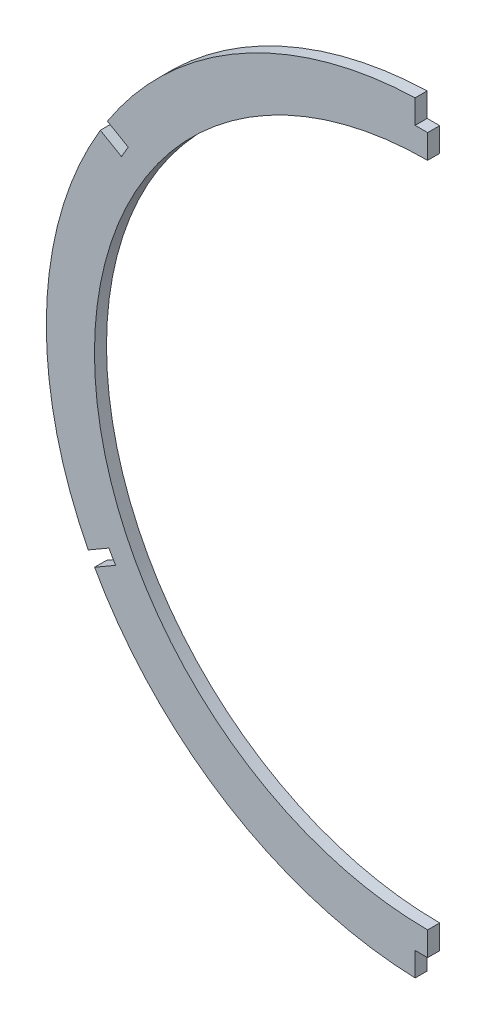
ISO-10303-21;
HEADER;
FILE_DESCRIPTION(('STEP AP214'),'2;1');
FILE_NAME('part.step','',(''),(''),'','','');
FILE_SCHEMA(('AUTOMOTIVE_DESIGN { 1 0 10303 214 1 1 1 1 }'));
ENDSEC;
DATA;
#1=APPLICATION_CONTEXT('core data for automotive mechanical design processes');
#2=APPLICATION_PROTOCOL_DEFINITION('international standard','automotive_design',2000,#1);
#3=PRODUCT_CONTEXT('',#1,'mechanical');
#4=PRODUCT('Part','Part','',(#3));
#5=PRODUCT_RELATED_PRODUCT_CATEGORY('part','',(#4));
#6=PRODUCT_DEFINITION_FORMATION('','',#4);
#7=PRODUCT_DEFINITION_CONTEXT('part definition',#1,'design');
#8=PRODUCT_DEFINITION('design','',#6,#7);
#9=PRODUCT_DEFINITION_SHAPE('','',#8);
#10=(LENGTH_UNIT() NAMED_UNIT(*) SI_UNIT(.MILLI.,.METRE.));
#11=(NAMED_UNIT(*) PLANE_ANGLE_UNIT() SI_UNIT($,.RADIAN.));
#12=(NAMED_UNIT(*) SI_UNIT($,.STERADIAN.) SOLID_ANGLE_UNIT());
#13=UNCERTAINTY_MEASURE_WITH_UNIT(LENGTH_MEASURE(1.E-05),#10,'distance_accuracy_value','');
#14=(GEOMETRIC_REPRESENTATION_CONTEXT(3) GLOBAL_UNCERTAINTY_ASSIGNED_CONTEXT((#13)) GLOBAL_UNIT_ASSIGNED_CONTEXT((#10,
#11,#12)) REPRESENTATION_CONTEXT('',''));
#15=CARTESIAN_POINT('',(0.,0.,0.));
#16=DIRECTION('',(0.,0.,1.));
#17=DIRECTION('',(1.,0.,0.));
#18=AXIS2_PLACEMENT_3D('',#15,#16,#17);
#19=CARTESIAN_POINT('',(0.,6.07817424837746,-3.175));
#20=DIRECTION('',(0.,0.,1.));
#21=DIRECTION('',(1.,0.,0.));
#22=AXIS2_PLACEMENT_3D('',#19,#20,#21);
#23=CYLINDRICAL_SURFACE('',#22,100.601825751622);
#24=DIRECTION('',(0.,0.,1.));
#25=VECTOR('',#24,1.);
#26=CARTESIAN_POINT('',(-89.5376660151082,-39.7883027160326,-3.175));
#27=LINE('',#26,#25);
#28=CARTESIAN_POINT('',(-89.5376660151082,-39.7883027160326,0.));
#29=VERTEX_POINT('',#28);
#30=CARTESIAN_POINT('',(-89.5376660151081,-39.7883027160326,-3.175));
#31=VERTEX_POINT('',#30);
#32=EDGE_CURVE('E233',#29,#31,#27,.F.);
#33=ORIENTED_EDGE('',*,*,#32,.F.);
#34=CARTESIAN_POINT('',(0.,6.07817424837746,0.));
#35=DIRECTION('',(0.,0.,1.));
#36=DIRECTION('',(1.,0.,0.));
#37=AXIS2_PLACEMENT_3D('',#34,#35,#36);
#38=CIRCLE('',#37,100.601825751622);
#39=CARTESIAN_POINT('',(-86.3554854902251,57.6868699333813,0.));
#40=VERTEX_POINT('',#39);
#41=EDGE_CURVE('E171',#40,#29,#38,.T.);
#42=ORIENTED_EDGE('',*,*,#41,.F.);
#43=DIRECTION('',(0.,0.,1.));
#44=VECTOR('',#43,1.);
#45=CARTESIAN_POINT('',(-86.3554854902251,57.6868699333813,-3.175));
#46=LINE('',#45,#44);
#47=CARTESIAN_POINT('',(-86.355485490225,57.6868699333813,-3.175));
#48=VERTEX_POINT('',#47);
#49=EDGE_CURVE('E58',#48,#40,#46,.T.);
#50=ORIENTED_EDGE('',*,*,#49,.F.);
#51=CARTESIAN_POINT('',(0.,6.07817424837746,-3.175));
#52=DIRECTION('',(0.,0.,1.));
#53=DIRECTION('',(1.,0.,0.));
#54=AXIS2_PLACEMENT_3D('',#51,#52,#53);
#55=CIRCLE('',#54,100.601825751622);
#56=EDGE_CURVE('E255',#48,#31,#55,.T.);
#57=ORIENTED_EDGE('',*,*,#56,.T.);
#58=EDGE_LOOP('',(#33,#42,#50,#57));
#59=FACE_BOUND('',#58,.T.);
#60=ADVANCED_FACE('F36',(#59),#23,.T.);
#61=DIRECTION('',(0.,0.,1.));
#62=VECTOR('',#61,1.);
#63=CARTESIAN_POINT('',(-3.302,106.625795505968,-3.175));
#64=LINE('',#63,#62);
#65=CARTESIAN_POINT('',(-3.302,106.625795505968,-3.175));
#66=VERTEX_POINT('',#65);
#67=CARTESIAN_POINT('',(-3.302,106.625795505968,0.));
#68=VERTEX_POINT('',#67);
#69=EDGE_CURVE('E237',#66,#68,#64,.T.);
#70=ORIENTED_EDGE('',*,*,#69,.F.);
#71=CARTESIAN_POINT('',(-84.490367240827,60.6868291308226,-3.175));
#72=VERTEX_POINT('',#71);
#73=EDGE_CURVE('E257',#66,#72,#55,.T.);
#74=ORIENTED_EDGE('',*,*,#73,.T.);
#75=DIRECTION('',(0.,0.,1.));
#76=VECTOR('',#75,1.);
#77=CARTESIAN_POINT('',(-84.490367240827,60.6868291308226,-3.175));
#78=LINE('',#77,#76);
#79=CARTESIAN_POINT('',(-84.490367240827,60.6868291308226,0.));
#80=VERTEX_POINT('',#79);
#81=EDGE_CURVE('E230',#80,#72,#78,.F.);
#82=ORIENTED_EDGE('',*,*,#81,.F.);
#83=EDGE_CURVE('E256',#68,#80,#38,.T.);
#84=ORIENTED_EDGE('',*,*,#83,.F.);
#85=EDGE_LOOP('',(#70,#74,#82,#84));
#86=FACE_BOUND('',#85,.T.);
#87=ADVANCED_FACE('F279',(#86),#23,.T.);
#88=DIRECTION('',(0.,0.,1.));
#89=VECTOR('',#88,1.);
#90=CARTESIAN_POINT('',(-3.30199999999999,-94.4694470092128,-3.175));
#91=LINE('',#90,#89);
#92=CARTESIAN_POINT('',(-3.30199999999999,-94.4694470092128,0.));
#93=VERTEX_POINT('',#92);
#94=CARTESIAN_POINT('',(-3.30199999999999,-94.4694470092127,-3.175));
#95=VERTEX_POINT('',#94);
#96=EDGE_CURVE('E235',#93,#95,#91,.F.);
#97=ORIENTED_EDGE('',*,*,#96,.F.);
#98=CARTESIAN_POINT('',(-87.8721842645062,-42.903522099794,0.));
#99=VERTEX_POINT('',#98);
#100=EDGE_CURVE('E248',#99,#93,#38,.T.);
#101=ORIENTED_EDGE('',*,*,#100,.F.);
#102=DIRECTION('',(0.,0.,1.));
#103=VECTOR('',#102,1.);
#104=CARTESIAN_POINT('',(-87.8721842645062,-42.903522099794,-3.175));
#105=LINE('',#104,#103);
#106=CARTESIAN_POINT('',(-87.8721842645062,-42.903522099794,-3.175));
#107=VERTEX_POINT('',#106);
#108=EDGE_CURVE('E50',#107,#99,#105,.T.);
#109=ORIENTED_EDGE('',*,*,#108,.F.);
#110=EDGE_CURVE('E252',#107,#95,#55,.T.);
#111=ORIENTED_EDGE('',*,*,#110,.T.);
#112=EDGE_LOOP('',(#97,#101,#109,#111));
#113=FACE_BOUND('',#112,.T.);
#114=ADVANCED_FACE('F38',(#113),#23,.T.);
#115=CARTESIAN_POINT('',(0.,6.07817424837746,-3.175));
#116=DIRECTION('',(0.,0.,1.));
#117=DIRECTION('',(1.,0.,0.));
#118=AXIS2_PLACEMENT_3D('',#115,#116,#117);
#119=PLANE('',#118);
#120=ORIENTED_EDGE('',*,*,#73,.F.);
#121=DIRECTION('',(0.,-1.,0.));
#122=VECTOR('',#121,1.);
#123=CARTESIAN_POINT('',(-3.302,110.295839278736,-3.175));
#124=LINE('',#123,#122);
#125=CARTESIAN_POINT('',(-3.302,100.33,-3.175));
#126=VERTEX_POINT('',#125);
#127=EDGE_CURVE('E208',#66,#126,#124,.T.);
#128=ORIENTED_EDGE('',*,*,#127,.T.);
#129=DIRECTION('',(1.,0.,0.));
#130=VECTOR('',#129,1.);
#131=CARTESIAN_POINT('',(-3.302,100.33,-3.175));
#132=LINE('',#131,#130);
#133=CARTESIAN_POINT('',(0.,100.33,-3.175));
#134=VERTEX_POINT('',#133);
#135=EDGE_CURVE('E202',#126,#134,#132,.T.);
#136=ORIENTED_EDGE('',*,*,#135,.T.);
#137=DIRECTION('',(0.,1.,0.));
#138=VECTOR('',#137,1.);
#139=CARTESIAN_POINT('',(0.,6.07817424837746,-3.175));
#140=LINE('',#139,#138);
#141=CARTESIAN_POINT('',(0.,93.98,-3.175));
#142=VERTEX_POINT('',#141);
#143=EDGE_CURVE('E244',#142,#134,#140,.T.);
#144=ORIENTED_EDGE('',*,*,#143,.F.);
#145=CARTESIAN_POINT('',(0.,6.07817424837746,-3.175));
#146=DIRECTION('',(0.,0.,1.));
#147=DIRECTION('',(1.,0.,0.));
#148=AXIS2_PLACEMENT_3D('',#145,#146,#147);
#149=CIRCLE('',#148,87.9018257516225);
#150=CARTESIAN_POINT('',(0.,-81.8236515032451,-3.175));
#151=VERTEX_POINT('',#150);
#152=EDGE_CURVE('E245',#142,#151,#149,.T.);
#153=ORIENTED_EDGE('',*,*,#152,.T.);
#154=CARTESIAN_POINT('',(0.,-88.1736515032451,-3.175));
#155=VERTEX_POINT('',#154);
#156=EDGE_CURVE('E241',#155,#151,#140,.T.);
#157=ORIENTED_EDGE('',*,*,#156,.F.);
#158=DIRECTION('',(-1.,0.,0.));
#159=VECTOR('',#158,1.);
#160=CARTESIAN_POINT('',(0.,-88.1736515032451,-3.175));
#161=LINE('',#160,#159);
#162=CARTESIAN_POINT('',(-3.30199999999999,-88.1736515032451,-3.175));
#163=VERTEX_POINT('',#162);
#164=EDGE_CURVE('E192',#155,#163,#161,.T.);
#165=ORIENTED_EDGE('',*,*,#164,.T.);
#166=DIRECTION('',(0.,-1.,0.));
#167=VECTOR('',#166,1.);
#168=CARTESIAN_POINT('',(-3.30199999999999,-88.1736515032451,-3.175));
#169=LINE('',#168,#167);
#170=EDGE_CURVE('E186',#163,#95,#169,.T.);
#171=ORIENTED_EDGE('',*,*,#170,.T.);
#172=ORIENTED_EDGE('',*,*,#110,.F.);
#173=DIRECTION('',(0.86602540378444,0.499999999999997,0.));
#174=VECTOR('',#173,1.);
#175=CARTESIAN_POINT('',(-90.4575356913942,-44.3961754420575,-3.175));
#176=LINE('',#175,#174);
#177=CARTESIAN_POINT('',(-82.3297448298109,-39.7035932002055,-3.175));
#178=VERTEX_POINT('',#177);
#179=EDGE_CURVE('E180',#107,#178,#176,.T.);
#180=ORIENTED_EDGE('',*,*,#179,.T.);
#181=DIRECTION('',(-0.5,0.866025403784439,0.));
#182=VECTOR('',#181,1.);
#183=CARTESIAN_POINT('',(-84.095044829811,-36.6460039096041,-3.175));
#184=LINE('',#183,#182);
#185=CARTESIAN_POINT('',(-84.095044829811,-36.6460039096041,-3.175));
#186=VERTEX_POINT('',#185);
#187=EDGE_CURVE('E178',#178,#186,#184,.T.);
#188=ORIENTED_EDGE('',*,*,#187,.T.);
#189=DIRECTION('',(-0.866025403784437,-0.500000000000003,0.));
#190=VECTOR('',#189,1.);
#191=CARTESIAN_POINT('',(-92.2228356913943,-41.3385861514562,-3.175));
#192=LINE('',#191,#190);
#193=EDGE_CURVE('E154',#186,#31,#192,.T.);
#194=ORIENTED_EDGE('',*,*,#193,.T.);
#195=ORIENTED_EDGE('',*,*,#56,.F.);
#196=DIRECTION('',(0.866025403784439,-0.499999999999999,0.));
#197=VECTOR('',#196,1.);
#198=CARTESIAN_POINT('',(-89.8744108222375,59.7185224210769,-3.175));
#199=LINE('',#198,#197);
#200=CARTESIAN_POINT('',(-80.7618623707427,54.4573901196029,-3.175));
#201=VERTEX_POINT('',#200);
#202=EDGE_CURVE('E214',#48,#201,#199,.T.);
#203=ORIENTED_EDGE('',*,*,#202,.T.);
#204=DIRECTION('',(0.500000000000001,0.866025403784438,0.));
#205=VECTOR('',#204,1.);
#206=CARTESIAN_POINT('',(-80.7618623707427,54.4573901196029,-3.175));
#207=LINE('',#206,#205);
#208=CARTESIAN_POINT('',(-78.9965623707427,57.5149794102042,-3.175));
#209=VERTEX_POINT('',#208);
#210=EDGE_CURVE('E217',#201,#209,#207,.T.);
#211=ORIENTED_EDGE('',*,*,#210,.T.);
#212=DIRECTION('',(-0.866025403784438,0.500000000000002,0.));
#213=VECTOR('',#212,1.);
#214=CARTESIAN_POINT('',(-88.1091108222374,62.7761117116782,-3.175));
#215=LINE('',#214,#213);
#216=EDGE_CURVE('E220',#209,#72,#215,.T.);
#217=ORIENTED_EDGE('',*,*,#216,.T.);
#218=EDGE_LOOP('',(#120,#128,#136,#144,#153,#157,#165,#171,#172,#180,#188,#194,#195,#203,#211,#217));
#219=FACE_BOUND('',#218,.T.);
#220=ADVANCED_FACE('F285',(#219),#119,.F.);
#221=CARTESIAN_POINT('',(0.,6.07817424837746,0.));
#222=DIRECTION('',(0.,0.,1.));
#223=DIRECTION('',(1.,0.,0.));
#224=AXIS2_PLACEMENT_3D('',#221,#222,#223);
#225=PLANE('',#224);
#226=DIRECTION('',(0.,-1.,0.));
#227=VECTOR('',#226,1.);
#228=CARTESIAN_POINT('',(-3.302,110.295839278736,0.));
#229=LINE('',#228,#227);
#230=CARTESIAN_POINT('',(-3.302,100.33,0.));
#231=VERTEX_POINT('',#230);
#232=EDGE_CURVE('E189',#68,#231,#229,.T.);
#233=ORIENTED_EDGE('',*,*,#232,.F.);
#234=ORIENTED_EDGE('',*,*,#83,.T.);
#235=DIRECTION('',(-0.866025403784438,0.500000000000002,0.));
#236=VECTOR('',#235,1.);
#237=CARTESIAN_POINT('',(-88.1091108222374,62.7761117116782,0.));
#238=LINE('',#237,#236);
#239=CARTESIAN_POINT('',(-78.9965623707427,57.5149794102042,0.));
#240=VERTEX_POINT('',#239);
#241=EDGE_CURVE('E175',#240,#80,#238,.T.);
#242=ORIENTED_EDGE('',*,*,#241,.F.);
#243=DIRECTION('',(0.500000000000001,0.866025403784438,0.));
#244=VECTOR('',#243,1.);
#245=CARTESIAN_POINT('',(-80.7618623707427,54.4573901196029,0.));
#246=LINE('',#245,#244);
#247=CARTESIAN_POINT('',(-80.7618623707427,54.4573901196029,0.));
#248=VERTEX_POINT('',#247);
#249=EDGE_CURVE('E172',#248,#240,#246,.T.);
#250=ORIENTED_EDGE('',*,*,#249,.F.);
#251=DIRECTION('',(0.866025403784439,-0.499999999999999,0.));
#252=VECTOR('',#251,1.);
#253=CARTESIAN_POINT('',(0.758349387140626,7.39167391679375,0.));
#254=LINE('',#253,#252);
#255=EDGE_CURVE('E44',#40,#248,#254,.T.);
#256=ORIENTED_EDGE('',*,*,#255,.F.);
#257=ORIENTED_EDGE('',*,*,#41,.T.);
#258=DIRECTION('',(-0.866025403784437,-0.500000000000003,0.));
#259=VECTOR('',#258,1.);
#260=CARTESIAN_POINT('',(-92.2228356913943,-41.3385861514562,0.));
#261=LINE('',#260,#259);
#262=CARTESIAN_POINT('',(-84.095044829811,-36.6460039096041,0.));
#263=VERTEX_POINT('',#262);
#264=EDGE_CURVE('E151',#263,#29,#261,.T.);
#265=ORIENTED_EDGE('',*,*,#264,.F.);
#266=DIRECTION('',(-0.5,0.866025403784439,0.));
#267=VECTOR('',#266,1.);
#268=CARTESIAN_POINT('',(-84.095044829811,-36.6460039096041,0.));
#269=LINE('',#268,#267);
#270=CARTESIAN_POINT('',(-82.3297448298109,-39.7035932002055,0.));
#271=VERTEX_POINT('',#270);
#272=EDGE_CURVE('E163',#271,#263,#269,.T.);
#273=ORIENTED_EDGE('',*,*,#272,.F.);
#274=DIRECTION('',(0.86602540378444,0.499999999999997,0.));
#275=VECTOR('',#274,1.);
#276=CARTESIAN_POINT('',(-0.758349387140411,7.39167391679339,0.));
#277=LINE('',#276,#275);
#278=EDGE_CURVE('E11',#99,#271,#277,.T.);
#279=ORIENTED_EDGE('',*,*,#278,.F.);
#280=ORIENTED_EDGE('',*,*,#100,.T.);
#281=DIRECTION('',(0.,-1.,0.));
#282=VECTOR('',#281,1.);
#283=CARTESIAN_POINT('',(-3.30199999999999,-88.1736515032451,0.));
#284=LINE('',#283,#282);
#285=CARTESIAN_POINT('',(-3.30199999999999,-88.1736515032451,0.));
#286=VERTEX_POINT('',#285);
#287=EDGE_CURVE('E190',#286,#93,#284,.T.);
#288=ORIENTED_EDGE('',*,*,#287,.F.);
#289=DIRECTION('',(-1.,0.,0.));
#290=VECTOR('',#289,1.);
#291=CARTESIAN_POINT('',(0.,-88.1736515032451,0.));
#292=LINE('',#291,#290);
#293=CARTESIAN_POINT('',(0.,-88.1736515032451,0.));
#294=VERTEX_POINT('',#293);
#295=EDGE_CURVE('E159',#294,#286,#292,.T.);
#296=ORIENTED_EDGE('',*,*,#295,.F.);
#297=DIRECTION('',(0.,1.,0.));
#298=VECTOR('',#297,1.);
#299=CARTESIAN_POINT('',(0.,6.07817424837746,0.));
#300=LINE('',#299,#298);
#301=CARTESIAN_POINT('',(0.,-81.8236515032451,0.));
#302=VERTEX_POINT('',#301);
#303=EDGE_CURVE('E239',#294,#302,#300,.T.);
#304=ORIENTED_EDGE('',*,*,#303,.T.);
#305=CARTESIAN_POINT('',(0.,6.07817424837746,0.));
#306=DIRECTION('',(0.,0.,1.));
#307=DIRECTION('',(1.,0.,0.));
#308=AXIS2_PLACEMENT_3D('',#305,#306,#307);
#309=CIRCLE('',#308,87.9018257516225);
#310=CARTESIAN_POINT('',(0.,93.98,0.));
#311=VERTEX_POINT('',#310);
#312=EDGE_CURVE('E249',#311,#302,#309,.T.);
#313=ORIENTED_EDGE('',*,*,#312,.F.);
#314=CARTESIAN_POINT('',(0.,100.33,0.));
#315=VERTEX_POINT('',#314);
#316=EDGE_CURVE('E242',#311,#315,#300,.T.);
#317=ORIENTED_EDGE('',*,*,#316,.T.);
#318=DIRECTION('',(1.,0.,0.));
#319=VECTOR('',#318,1.);
#320=CARTESIAN_POINT('',(-3.302,100.33,0.));
#321=LINE('',#320,#319);
#322=EDGE_CURVE('E206',#231,#315,#321,.T.);
#323=ORIENTED_EDGE('',*,*,#322,.F.);
#324=EDGE_LOOP('',(#233,#234,#242,#250,#256,#257,#265,#273,#279,#280,#288,#296,#304,#313,#317,#323));
#325=FACE_BOUND('',#324,.T.);
#326=ADVANCED_FACE('F169',(#325),#225,.T.);
#327=CARTESIAN_POINT('',(0.,6.07817424837746,-3.175));
#328=DIRECTION('',(0.,0.,1.));
#329=DIRECTION('',(1.,0.,0.));
#330=AXIS2_PLACEMENT_3D('',#327,#328,#329);
#331=CYLINDRICAL_SURFACE('',#330,87.9018257516225);
#332=DIRECTION('',(0.,0.,1.));
#333=VECTOR('',#332,1.);
#334=CARTESIAN_POINT('',(0.,93.98,-3.175));
#335=LINE('',#334,#333);
#336=EDGE_CURVE('E263',#311,#142,#335,.F.);
#337=ORIENTED_EDGE('',*,*,#336,.F.);
#338=ORIENTED_EDGE('',*,*,#312,.T.);
#339=DIRECTION('',(0.,0.,1.));
#340=VECTOR('',#339,1.);
#341=CARTESIAN_POINT('',(0.,-81.8236515032451,-3.175));
#342=LINE('',#341,#340);
#343=EDGE_CURVE('E260',#151,#302,#342,.T.);
#344=ORIENTED_EDGE('',*,*,#343,.F.);
#345=ORIENTED_EDGE('',*,*,#152,.F.);
#346=EDGE_LOOP('',(#337,#338,#344,#345));
#347=FACE_BOUND('',#346,.T.);
#348=ADVANCED_FACE('F309',(#347),#331,.F.);
#349=CARTESIAN_POINT('',(0.,0.,0.));
#350=DIRECTION('',(1.,0.,0.));
#351=DIRECTION('',(0.,0.,-1.));
#352=AXIS2_PLACEMENT_3D('',#349,#350,#351);
#353=PLANE('',#352);
#354=DIRECTION('',(0.,0.,1.));
#355=VECTOR('',#354,1.);
#356=CARTESIAN_POINT('',(0.,-88.1736515032451,-3.175));
#357=LINE('',#356,#355);
#358=EDGE_CURVE('E184',#155,#294,#357,.T.);
#359=ORIENTED_EDGE('',*,*,#358,.F.);
#360=ORIENTED_EDGE('',*,*,#156,.T.);
#361=ORIENTED_EDGE('',*,*,#343,.T.);
#362=ORIENTED_EDGE('',*,*,#303,.F.);
#363=EDGE_LOOP('',(#359,#360,#361,#362));
#364=FACE_BOUND('',#363,.T.);
#365=ADVANCED_FACE('F302',(#364),#353,.T.);
#366=DIRECTION('',(0.,0.,1.));
#367=VECTOR('',#366,1.);
#368=CARTESIAN_POINT('',(0.,100.33,-3.175));
#369=LINE('',#368,#367);
#370=EDGE_CURVE('E203',#134,#315,#369,.T.);
#371=ORIENTED_EDGE('',*,*,#370,.T.);
#372=ORIENTED_EDGE('',*,*,#316,.F.);
#373=ORIENTED_EDGE('',*,*,#336,.T.);
#374=ORIENTED_EDGE('',*,*,#143,.T.);
#375=EDGE_LOOP('',(#371,#372,#373,#374));
#376=FACE_BOUND('',#375,.T.);
#377=ADVANCED_FACE('F314',(#376),#353,.T.);
#378=CARTESIAN_POINT('',(-3.302,110.295839278736,-3.175));
#379=DIRECTION('',(-1.,0.,0.));
#380=DIRECTION('',(0.,-1.,0.));
#381=AXIS2_PLACEMENT_3D('',#378,#379,#380);
#382=PLANE('',#381);
#383=ORIENTED_EDGE('',*,*,#69,.T.);
#384=ORIENTED_EDGE('',*,*,#232,.T.);
#385=DIRECTION('',(0.,0.,1.));
#386=VECTOR('',#385,1.);
#387=CARTESIAN_POINT('',(-3.302,100.33,-3.175));
#388=LINE('',#387,#386);
#389=EDGE_CURVE('E199',#126,#231,#388,.T.);
#390=ORIENTED_EDGE('',*,*,#389,.F.);
#391=ORIENTED_EDGE('',*,*,#127,.F.);
#392=EDGE_LOOP('',(#383,#384,#390,#391));
#393=FACE_BOUND('',#392,.T.);
#394=ADVANCED_FACE('F319',(#393),#382,.F.);
#395=CARTESIAN_POINT('',(-3.302,100.33,-3.175));
#396=DIRECTION('',(0.,-1.,0.));
#397=DIRECTION('',(0.,0.,-1.));
#398=AXIS2_PLACEMENT_3D('',#395,#396,#397);
#399=PLANE('',#398);
#400=ORIENTED_EDGE('',*,*,#322,.T.);
#401=ORIENTED_EDGE('',*,*,#370,.F.);
#402=ORIENTED_EDGE('',*,*,#135,.F.);
#403=ORIENTED_EDGE('',*,*,#389,.T.);
#404=EDGE_LOOP('',(#400,#401,#402,#403));
#405=FACE_BOUND('',#404,.T.);
#406=ADVANCED_FACE('F317',(#405),#399,.F.);
#407=CARTESIAN_POINT('',(-3.30199999999999,-88.1736515032451,-3.175));
#408=DIRECTION('',(-1.,0.,0.));
#409=DIRECTION('',(0.,-1.,0.));
#410=AXIS2_PLACEMENT_3D('',#407,#408,#409);
#411=PLANE('',#410);
#412=ORIENTED_EDGE('',*,*,#96,.T.);
#413=ORIENTED_EDGE('',*,*,#170,.F.);
#414=DIRECTION('',(0.,0.,1.));
#415=VECTOR('',#414,1.);
#416=CARTESIAN_POINT('',(-3.30199999999999,-88.1736515032451,-3.175));
#417=LINE('',#416,#415);
#418=EDGE_CURVE('E187',#163,#286,#417,.T.);
#419=ORIENTED_EDGE('',*,*,#418,.T.);
#420=ORIENTED_EDGE('',*,*,#287,.T.);
#421=EDGE_LOOP('',(#412,#413,#419,#420));
#422=FACE_BOUND('',#421,.T.);
#423=ADVANCED_FACE('F295',(#422),#411,.F.);
#424=CARTESIAN_POINT('',(0.,-88.1736515032451,-3.175));
#425=DIRECTION('',(0.,1.,0.));
#426=DIRECTION('',(0.,0.,1.));
#427=AXIS2_PLACEMENT_3D('',#424,#425,#426);
#428=PLANE('',#427);
#429=ORIENTED_EDGE('',*,*,#295,.T.);
#430=ORIENTED_EDGE('',*,*,#418,.F.);
#431=ORIENTED_EDGE('',*,*,#164,.F.);
#432=ORIENTED_EDGE('',*,*,#358,.T.);
#433=EDGE_LOOP('',(#429,#430,#431,#432));
#434=FACE_BOUND('',#433,.T.);
#435=ADVANCED_FACE('F298',(#434),#428,.F.);
#436=CARTESIAN_POINT('',(-88.1091108222374,62.7761117116782,-3.175));
#437=DIRECTION('',(0.500000000000002,0.866025403784438,0.));
#438=DIRECTION('',(-0.866025403784438,0.500000000000002,0.));
#439=AXIS2_PLACEMENT_3D('',#436,#437,#438);
#440=PLANE('',#439);
#441=ORIENTED_EDGE('',*,*,#81,.T.);
#442=ORIENTED_EDGE('',*,*,#216,.F.);
#443=DIRECTION('',(0.,0.,1.));
#444=VECTOR('',#443,1.);
#445=CARTESIAN_POINT('',(-78.9965623707427,57.5149794102042,-3.175));
#446=LINE('',#445,#444);
#447=EDGE_CURVE('E225',#209,#240,#446,.T.);
#448=ORIENTED_EDGE('',*,*,#447,.T.);
#449=ORIENTED_EDGE('',*,*,#241,.T.);
#450=EDGE_LOOP('',(#441,#442,#448,#449));
#451=FACE_BOUND('',#450,.T.);
#452=ADVANCED_FACE('F274',(#451),#440,.F.);
#453=CARTESIAN_POINT('',(-80.7618623707427,54.4573901196029,-3.175));
#454=DIRECTION('',(0.866025403784438,-0.500000000000001,0.));
#455=DIRECTION('',(0.500000000000001,0.866025403784438,0.));
#456=AXIS2_PLACEMENT_3D('',#453,#454,#455);
#457=PLANE('',#456);
#458=ORIENTED_EDGE('',*,*,#249,.T.);
#459=ORIENTED_EDGE('',*,*,#447,.F.);
#460=ORIENTED_EDGE('',*,*,#210,.F.);
#461=DIRECTION('',(0.,0.,1.));
#462=VECTOR('',#461,1.);
#463=CARTESIAN_POINT('',(-80.7618623707427,54.4573901196029,-3.175));
#464=LINE('',#463,#462);
#465=EDGE_CURVE('E222',#201,#248,#464,.T.);
#466=ORIENTED_EDGE('',*,*,#465,.T.);
#467=EDGE_LOOP('',(#458,#459,#460,#466));
#468=FACE_BOUND('',#467,.T.);
#469=ADVANCED_FACE('F268',(#468),#457,.F.);
#470=CARTESIAN_POINT('',(-89.8744108222375,59.7185224210769,-3.175));
#471=DIRECTION('',(-0.499999999999999,-0.866025403784439,0.));
#472=DIRECTION('',(0.866025403784439,-0.499999999999999,0.));
#473=AXIS2_PLACEMENT_3D('',#470,#471,#472);
#474=PLANE('',#473);
#475=ORIENTED_EDGE('',*,*,#49,.T.);
#476=ORIENTED_EDGE('',*,*,#255,.T.);
#477=ORIENTED_EDGE('',*,*,#465,.F.);
#478=ORIENTED_EDGE('',*,*,#202,.F.);
#479=EDGE_LOOP('',(#475,#476,#477,#478));
#480=FACE_BOUND('',#479,.T.);
#481=ADVANCED_FACE('F264',(#480),#474,.F.);
#482=CARTESIAN_POINT('',(-92.2228356913943,-41.3385861514562,-3.175));
#483=DIRECTION('',(-0.500000000000003,0.866025403784437,0.));
#484=DIRECTION('',(-0.866025403784437,-0.500000000000003,0.));
#485=AXIS2_PLACEMENT_3D('',#482,#483,#484);
#486=PLANE('',#485);
#487=ORIENTED_EDGE('',*,*,#32,.T.);
#488=ORIENTED_EDGE('',*,*,#193,.F.);
#489=DIRECTION('',(0.,0.,1.));
#490=VECTOR('',#489,1.);
#491=CARTESIAN_POINT('',(-84.095044829811,-36.6460039096041,-3.175));
#492=LINE('',#491,#490);
#493=EDGE_CURVE('E147',#186,#263,#492,.T.);
#494=ORIENTED_EDGE('',*,*,#493,.T.);
#495=ORIENTED_EDGE('',*,*,#264,.T.);
#496=EDGE_LOOP('',(#487,#488,#494,#495));
#497=FACE_BOUND('',#496,.T.);
#498=ADVANCED_FACE('F149',(#497),#486,.F.);
#499=CARTESIAN_POINT('',(-84.095044829811,-36.6460039096041,-3.175));
#500=DIRECTION('',(0.866025403784439,0.5,0.));
#501=DIRECTION('',(-0.5,0.866025403784439,0.));
#502=AXIS2_PLACEMENT_3D('',#499,#500,#501);
#503=PLANE('',#502);
#504=ORIENTED_EDGE('',*,*,#272,.T.);
#505=ORIENTED_EDGE('',*,*,#493,.F.);
#506=ORIENTED_EDGE('',*,*,#187,.F.);
#507=DIRECTION('',(0.,0.,1.));
#508=VECTOR('',#507,1.);
#509=CARTESIAN_POINT('',(-82.3297448298109,-39.7035932002055,-3.175));
#510=LINE('',#509,#508);
#511=EDGE_CURVE('E158',#178,#271,#510,.T.);
#512=ORIENTED_EDGE('',*,*,#511,.T.);
#513=EDGE_LOOP('',(#504,#505,#506,#512));
#514=FACE_BOUND('',#513,.T.);
#515=ADVANCED_FACE('F164',(#514),#503,.F.);
#516=CARTESIAN_POINT('',(-90.4575356913942,-44.3961754420575,-3.175));
#517=DIRECTION('',(0.499999999999997,-0.86602540378444,0.));
#518=DIRECTION('',(0.86602540378444,0.499999999999997,0.));
#519=AXIS2_PLACEMENT_3D('',#516,#517,#518);
#520=PLANE('',#519);
#521=ORIENTED_EDGE('',*,*,#108,.T.);
#522=ORIENTED_EDGE('',*,*,#278,.T.);
#523=ORIENTED_EDGE('',*,*,#511,.F.);
#524=ORIENTED_EDGE('',*,*,#179,.F.);
#525=EDGE_LOOP('',(#521,#522,#523,#524));
#526=FACE_BOUND('',#525,.T.);
#527=ADVANCED_FACE('F287',(#526),#520,.F.);
#528=CLOSED_SHELL('',(#60,#87,#114,#220,#326,#348,#365,#377,#394,#406,#423,#435,#452,#469,#481,
#498,#515,#527));
#529=MANIFOLD_SOLID_BREP('B2',#528);
#530=ADVANCED_BREP_SHAPE_REPRESENTATION('',(#18,#529),#14);
#531=SHAPE_DEFINITION_REPRESENTATION(#9,#530);
ENDSEC;
END-ISO-10303-21;
